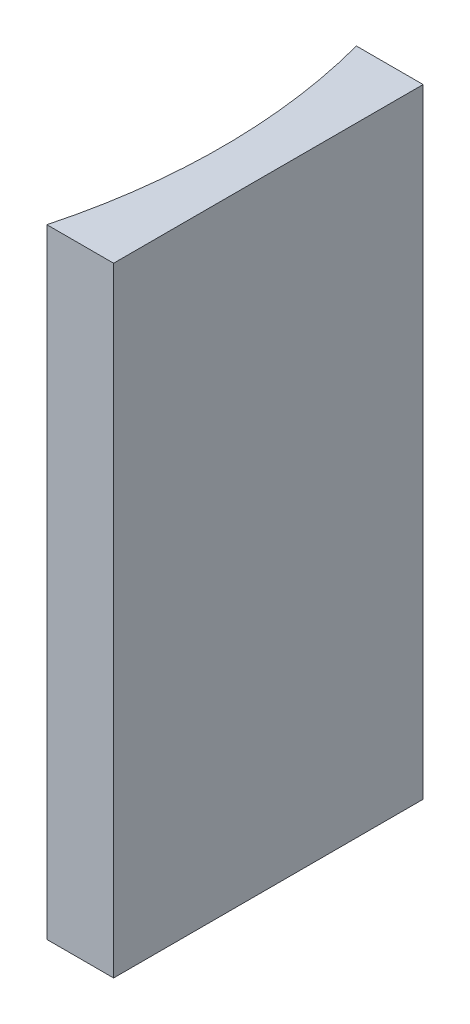
ISO-10303-21;
HEADER;
FILE_DESCRIPTION(('STEP AP214'),'2;1');
FILE_NAME('part.step','',(''),(''),'','','');
FILE_SCHEMA(('AUTOMOTIVE_DESIGN { 1 0 10303 214 1 1 1 1 }'));
ENDSEC;
DATA;
#1=APPLICATION_CONTEXT('core data for automotive mechanical design processes');
#2=APPLICATION_PROTOCOL_DEFINITION('international standard','automotive_design',2000,#1);
#3=PRODUCT_CONTEXT('',#1,'mechanical');
#4=PRODUCT('Part','Part','',(#3));
#5=PRODUCT_RELATED_PRODUCT_CATEGORY('part','',(#4));
#6=PRODUCT_DEFINITION_FORMATION('','',#4);
#7=PRODUCT_DEFINITION_CONTEXT('part definition',#1,'design');
#8=PRODUCT_DEFINITION('design','',#6,#7);
#9=PRODUCT_DEFINITION_SHAPE('','',#8);
#10=(LENGTH_UNIT() NAMED_UNIT(*) SI_UNIT(.MILLI.,.METRE.));
#11=(NAMED_UNIT(*) PLANE_ANGLE_UNIT() SI_UNIT($,.RADIAN.));
#12=(NAMED_UNIT(*) SI_UNIT($,.STERADIAN.) SOLID_ANGLE_UNIT());
#13=UNCERTAINTY_MEASURE_WITH_UNIT(LENGTH_MEASURE(1.E-05),#10,'distance_accuracy_value','');
#14=(GEOMETRIC_REPRESENTATION_CONTEXT(3) GLOBAL_UNCERTAINTY_ASSIGNED_CONTEXT((#13)) GLOBAL_UNIT_ASSIGNED_CONTEXT((#10,
#11,#12)) REPRESENTATION_CONTEXT('',''));
#15=CARTESIAN_POINT('',(0.,0.,0.));
#16=DIRECTION('',(0.,0.,1.));
#17=DIRECTION('',(1.,0.,0.));
#18=AXIS2_PLACEMENT_3D('',#15,#16,#17);
#19=CARTESIAN_POINT('',(0.,40.,0.));
#20=DIRECTION('',(0.,0.,1.));
#21=DIRECTION('',(1.,0.,0.));
#22=AXIS2_PLACEMENT_3D('',#19,#20,#21);
#23=PLANE('',#22);
#24=DIRECTION('',(-1.,0.,0.));
#25=VECTOR('',#24,1.);
#26=CARTESIAN_POINT('',(0.,0.,0.));
#27=LINE('',#26,#25);
#28=CARTESIAN_POINT('',(0.,0.,0.));
#29=VERTEX_POINT('',#28);
#30=CARTESIAN_POINT('',(-4.31150123103408,0.,0.));
#31=VERTEX_POINT('',#30);
#32=EDGE_CURVE('E100',#29,#31,#27,.T.);
#33=ORIENTED_EDGE('',*,*,#32,.T.);
#34=DIRECTION('',(0.,-1.,0.));
#35=VECTOR('',#34,1.);
#36=CARTESIAN_POINT('',(-4.31150123103408,40.,0.));
#37=LINE('',#36,#35);
#38=CARTESIAN_POINT('',(-4.31150123103408,40.,0.));
#39=VERTEX_POINT('',#38);
#40=EDGE_CURVE('E11',#39,#31,#37,.T.);
#41=ORIENTED_EDGE('',*,*,#40,.F.);
#42=DIRECTION('',(-1.,0.,0.));
#43=VECTOR('',#42,1.);
#44=CARTESIAN_POINT('',(0.,40.,0.));
#45=LINE('',#44,#43);
#46=CARTESIAN_POINT('',(0.,40.,0.));
#47=VERTEX_POINT('',#46);
#48=EDGE_CURVE('E88',#47,#39,#45,.T.);
#49=ORIENTED_EDGE('',*,*,#48,.F.);
#50=DIRECTION('',(0.,-1.,0.));
#51=VECTOR('',#50,1.);
#52=CARTESIAN_POINT('',(0.,40.,0.));
#53=LINE('',#52,#51);
#54=EDGE_CURVE('E96',#47,#29,#53,.T.);
#55=ORIENTED_EDGE('',*,*,#54,.T.);
#56=EDGE_LOOP('',(#33,#41,#49,#55));
#57=FACE_BOUND('',#56,.T.);
#58=ADVANCED_FACE('F37',(#57),#23,.F.);
#59=CARTESIAN_POINT('',(-41.78,40.,10.));
#60=DIRECTION('',(0.,-1.,0.));
#61=DIRECTION('',(0.,0.,-1.));
#62=AXIS2_PLACEMENT_3D('',#59,#60,#61);
#63=CYLINDRICAL_SURFACE('',#62,38.78);
#64=CARTESIAN_POINT('',(-41.78,0.,10.));
#65=DIRECTION('',(0.,-1.,0.));
#66=DIRECTION('',(0.,0.,1.));
#67=AXIS2_PLACEMENT_3D('',#64,#65,#66);
#68=CIRCLE('',#67,38.78);
#69=CARTESIAN_POINT('',(-4.31150123103408,0.,20.));
#70=VERTEX_POINT('',#69);
#71=EDGE_CURVE('E92',#31,#70,#68,.T.);
#72=ORIENTED_EDGE('',*,*,#71,.T.);
#73=DIRECTION('',(0.,-1.,0.));
#74=VECTOR('',#73,1.);
#75=CARTESIAN_POINT('',(-4.31150123103408,40.,20.));
#76=LINE('',#75,#74);
#77=CARTESIAN_POINT('',(-4.31150123103408,40.,20.));
#78=VERTEX_POINT('',#77);
#79=EDGE_CURVE('E45',#78,#70,#76,.T.);
#80=ORIENTED_EDGE('',*,*,#79,.F.);
#81=CARTESIAN_POINT('',(-41.78,40.,10.));
#82=DIRECTION('',(0.,-1.,0.));
#83=DIRECTION('',(0.,0.,1.));
#84=AXIS2_PLACEMENT_3D('',#81,#82,#83);
#85=CIRCLE('',#84,38.78);
#86=EDGE_CURVE('E83',#39,#78,#85,.T.);
#87=ORIENTED_EDGE('',*,*,#86,.F.);
#88=ORIENTED_EDGE('',*,*,#40,.T.);
#89=EDGE_LOOP('',(#72,#80,#87,#88));
#90=FACE_BOUND('',#89,.T.);
#91=ADVANCED_FACE('F91',(#90),#63,.F.);
#92=CARTESIAN_POINT('',(0.,40.,20.));
#93=DIRECTION('',(0.,0.,-1.));
#94=DIRECTION('',(-1.,0.,0.));
#95=AXIS2_PLACEMENT_3D('',#92,#93,#94);
#96=PLANE('',#95);
#97=DIRECTION('',(1.,0.,0.));
#98=VECTOR('',#97,1.);
#99=CARTESIAN_POINT('',(0.,0.,20.));
#100=LINE('',#99,#98);
#101=CARTESIAN_POINT('',(0.,0.,20.));
#102=VERTEX_POINT('',#101);
#103=EDGE_CURVE('E70',#70,#102,#100,.T.);
#104=ORIENTED_EDGE('',*,*,#103,.T.);
#105=DIRECTION('',(0.,-1.,0.));
#106=VECTOR('',#105,1.);
#107=CARTESIAN_POINT('',(0.,40.,20.));
#108=LINE('',#107,#106);
#109=CARTESIAN_POINT('',(0.,40.,20.));
#110=VERTEX_POINT('',#109);
#111=EDGE_CURVE('E93',#110,#102,#108,.T.);
#112=ORIENTED_EDGE('',*,*,#111,.F.);
#113=DIRECTION('',(1.,0.,0.));
#114=VECTOR('',#113,1.);
#115=CARTESIAN_POINT('',(0.,40.,20.));
#116=LINE('',#115,#114);
#117=EDGE_CURVE('E86',#78,#110,#116,.T.);
#118=ORIENTED_EDGE('',*,*,#117,.F.);
#119=ORIENTED_EDGE('',*,*,#79,.T.);
#120=EDGE_LOOP('',(#104,#112,#118,#119));
#121=FACE_BOUND('',#120,.T.);
#122=ADVANCED_FACE('F94',(#121),#96,.F.);
#123=CARTESIAN_POINT('',(0.,40.,0.));
#124=DIRECTION('',(-1.,0.,0.));
#125=DIRECTION('',(0.,0.,1.));
#126=AXIS2_PLACEMENT_3D('',#123,#124,#125);
#127=PLANE('',#126);
#128=DIRECTION('',(0.,0.,-1.));
#129=VECTOR('',#128,1.);
#130=CARTESIAN_POINT('',(0.,0.,0.));
#131=LINE('',#130,#129);
#132=EDGE_CURVE('E76',#102,#29,#131,.T.);
#133=ORIENTED_EDGE('',*,*,#132,.T.);
#134=ORIENTED_EDGE('',*,*,#54,.F.);
#135=DIRECTION('',(0.,0.,-1.));
#136=VECTOR('',#135,1.);
#137=CARTESIAN_POINT('',(0.,40.,0.));
#138=LINE('',#137,#136);
#139=EDGE_CURVE('E53',#110,#47,#138,.T.);
#140=ORIENTED_EDGE('',*,*,#139,.F.);
#141=ORIENTED_EDGE('',*,*,#111,.T.);
#142=EDGE_LOOP('',(#133,#134,#140,#141));
#143=FACE_BOUND('',#142,.T.);
#144=ADVANCED_FACE('F107',(#143),#127,.F.);
#145=CARTESIAN_POINT('',(-41.78,40.,10.));
#146=DIRECTION('',(0.,1.,0.));
#147=DIRECTION('',(0.,0.,1.));
#148=AXIS2_PLACEMENT_3D('',#145,#146,#147);
#149=PLANE('',#148);
#150=ORIENTED_EDGE('',*,*,#48,.T.);
#151=ORIENTED_EDGE('',*,*,#86,.T.);
#152=ORIENTED_EDGE('',*,*,#117,.T.);
#153=ORIENTED_EDGE('',*,*,#139,.T.);
#154=EDGE_LOOP('',(#150,#151,#152,#153));
#155=FACE_BOUND('',#154,.T.);
#156=ADVANCED_FACE('F84',(#155),#149,.T.);
#157=CARTESIAN_POINT('',(-41.78,0.,10.));
#158=DIRECTION('',(0.,1.,0.));
#159=DIRECTION('',(0.,0.,1.));
#160=AXIS2_PLACEMENT_3D('',#157,#158,#159);
#161=PLANE('',#160);
#162=ORIENTED_EDGE('',*,*,#32,.F.);
#163=ORIENTED_EDGE('',*,*,#132,.F.);
#164=ORIENTED_EDGE('',*,*,#103,.F.);
#165=ORIENTED_EDGE('',*,*,#71,.F.);
#166=EDGE_LOOP('',(#162,#163,#164,#165));
#167=FACE_BOUND('',#166,.T.);
#168=ADVANCED_FACE('F110',(#167),#161,.F.);
#169=CLOSED_SHELL('',(#58,#91,#122,#144,#156,#168));
#170=MANIFOLD_SOLID_BREP('B2',#169);
#171=ADVANCED_BREP_SHAPE_REPRESENTATION('',(#18,#170),#14);
#172=SHAPE_DEFINITION_REPRESENTATION(#9,#171);
ENDSEC;
END-ISO-10303-21;
